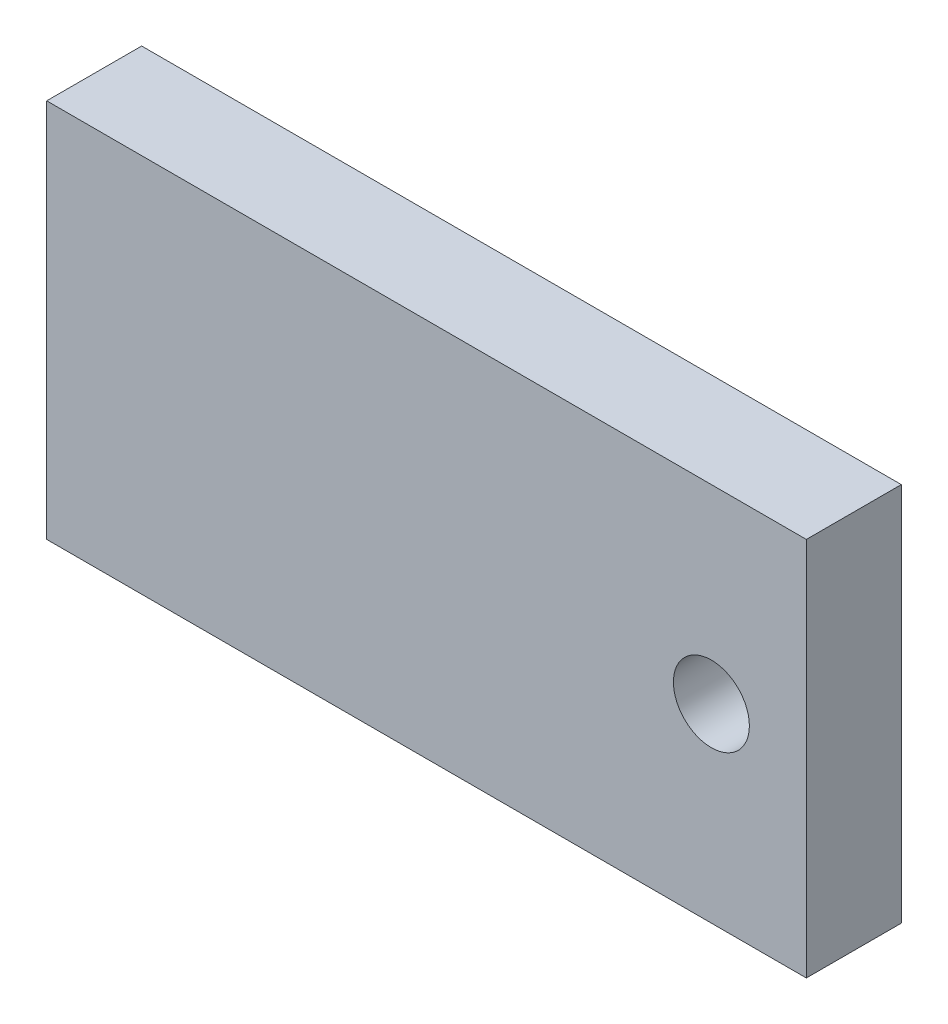
ISO-10303-21;
HEADER;
FILE_DESCRIPTION(('STEP AP214'),'2;1');
FILE_NAME('part.step','',(''),(''),'','','');
FILE_SCHEMA(('AUTOMOTIVE_DESIGN { 1 0 10303 214 1 1 1 1 }'));
ENDSEC;
DATA;
#1=APPLICATION_CONTEXT('core data for automotive mechanical design processes');
#2=APPLICATION_PROTOCOL_DEFINITION('international standard','automotive_design',2000,#1);
#3=PRODUCT_CONTEXT('',#1,'mechanical');
#4=PRODUCT('Part','Part','',(#3));
#5=PRODUCT_RELATED_PRODUCT_CATEGORY('part','',(#4));
#6=PRODUCT_DEFINITION_FORMATION('','',#4);
#7=PRODUCT_DEFINITION_CONTEXT('part definition',#1,'design');
#8=PRODUCT_DEFINITION('design','',#6,#7);
#9=PRODUCT_DEFINITION_SHAPE('','',#8);
#10=(LENGTH_UNIT() NAMED_UNIT(*) SI_UNIT(.MILLI.,.METRE.));
#11=(NAMED_UNIT(*) PLANE_ANGLE_UNIT() SI_UNIT($,.RADIAN.));
#12=(NAMED_UNIT(*) SI_UNIT($,.STERADIAN.) SOLID_ANGLE_UNIT());
#13=UNCERTAINTY_MEASURE_WITH_UNIT(LENGTH_MEASURE(1.E-05),#10,'distance_accuracy_value','');
#14=(GEOMETRIC_REPRESENTATION_CONTEXT(3) GLOBAL_UNCERTAINTY_ASSIGNED_CONTEXT((#13)) GLOBAL_UNIT_ASSIGNED_CONTEXT((#10,
#11,#12)) REPRESENTATION_CONTEXT('',''));
#15=CARTESIAN_POINT('',(0.,0.,0.));
#16=DIRECTION('',(0.,0.,1.));
#17=DIRECTION('',(1.,0.,0.));
#18=AXIS2_PLACEMENT_3D('',#15,#16,#17);
#19=CARTESIAN_POINT('',(0.,0.,5.));
#20=DIRECTION('',(0.,0.,1.));
#21=DIRECTION('',(1.,0.,0.));
#22=AXIS2_PLACEMENT_3D('',#19,#20,#21);
#23=PLANE('',#22);
#24=DIRECTION('',(-1.,0.,0.));
#25=VECTOR('',#24,1.);
#26=CARTESIAN_POINT('',(10.6993238445632,22.6111721998938,5.));
#27=LINE('',#26,#25);
#28=CARTESIAN_POINT('',(10.6993238445632,22.6111721998938,5.));
#29=VERTEX_POINT('',#28);
#30=CARTESIAN_POINT('',(-29.3006761554368,22.6111721998938,5.));
#31=VERTEX_POINT('',#30);
#32=EDGE_CURVE('E85',#29,#31,#27,.T.);
#33=ORIENTED_EDGE('',*,*,#32,.T.);
#34=DIRECTION('',(0.,-1.,0.));
#35=VECTOR('',#34,1.);
#36=CARTESIAN_POINT('',(-29.3006761554368,22.6111721998938,5.));
#37=LINE('',#36,#35);
#38=CARTESIAN_POINT('',(-29.3006761554368,2.61117219989384,5.));
#39=VERTEX_POINT('',#38);
#40=EDGE_CURVE('E80',#31,#39,#37,.T.);
#41=ORIENTED_EDGE('',*,*,#40,.T.);
#42=DIRECTION('',(1.,0.,0.));
#43=VECTOR('',#42,1.);
#44=CARTESIAN_POINT('',(-29.3006761554368,2.61117219989384,5.));
#45=LINE('',#44,#43);
#46=CARTESIAN_POINT('',(10.6993238445632,2.61117219989384,5.));
#47=VERTEX_POINT('',#46);
#48=EDGE_CURVE('E83',#39,#47,#45,.T.);
#49=ORIENTED_EDGE('',*,*,#48,.T.);
#50=DIRECTION('',(0.,1.,0.));
#51=VECTOR('',#50,1.);
#52=CARTESIAN_POINT('',(10.6993238445632,2.61117219989384,5.));
#53=LINE('',#52,#51);
#54=EDGE_CURVE('E51',#47,#29,#53,.T.);
#55=ORIENTED_EDGE('',*,*,#54,.T.);
#56=EDGE_LOOP('',(#33,#41,#49,#55));
#57=FACE_BOUND('',#56,.T.);
#58=CARTESIAN_POINT('',(5.69932384456323,12.6111721998938,5.));
#59=DIRECTION('',(0.,0.,1.));
#60=DIRECTION('',(1.,0.,0.));
#61=AXIS2_PLACEMENT_3D('',#58,#59,#60);
#62=CIRCLE('',#61,2.);
#63=CARTESIAN_POINT('',(7.69932384456323,12.6111721998938,5.));
#64=VERTEX_POINT('',#63);
#65=EDGE_CURVE('E101',#64,#64,#62,.T.);
#66=ORIENTED_EDGE('',*,*,#65,.F.);
#67=EDGE_LOOP('',(#66));
#68=FACE_BOUND('',#67,.T.);
#69=ADVANCED_FACE('F34',(#57,#68),#23,.T.);
#70=CARTESIAN_POINT('',(0.,0.,0.));
#71=DIRECTION('',(0.,0.,1.));
#72=DIRECTION('',(1.,0.,0.));
#73=AXIS2_PLACEMENT_3D('',#70,#71,#72);
#74=PLANE('',#73);
#75=DIRECTION('',(-1.,0.,0.));
#76=VECTOR('',#75,1.);
#77=CARTESIAN_POINT('',(10.6993238445632,22.6111721998938,0.));
#78=LINE('',#77,#76);
#79=CARTESIAN_POINT('',(10.6993238445632,22.6111721998938,0.));
#80=VERTEX_POINT('',#79);
#81=CARTESIAN_POINT('',(-29.3006761554368,22.6111721998938,0.));
#82=VERTEX_POINT('',#81);
#83=EDGE_CURVE('E98',#80,#82,#78,.T.);
#84=ORIENTED_EDGE('',*,*,#83,.F.);
#85=DIRECTION('',(0.,1.,0.));
#86=VECTOR('',#85,1.);
#87=CARTESIAN_POINT('',(10.6993238445632,2.61117219989384,0.));
#88=LINE('',#87,#86);
#89=CARTESIAN_POINT('',(10.6993238445632,2.61117219989384,0.));
#90=VERTEX_POINT('',#89);
#91=EDGE_CURVE('E73',#90,#80,#88,.T.);
#92=ORIENTED_EDGE('',*,*,#91,.F.);
#93=DIRECTION('',(1.,0.,0.));
#94=VECTOR('',#93,1.);
#95=CARTESIAN_POINT('',(0.699323844563227,2.61117219989384,0.));
#96=LINE('',#95,#94);
#97=CARTESIAN_POINT('',(-29.3006761554368,2.61117219989384,0.));
#98=VERTEX_POINT('',#97);
#99=EDGE_CURVE('E67',#98,#90,#96,.T.);
#100=ORIENTED_EDGE('',*,*,#99,.F.);
#101=DIRECTION('',(0.,-1.,0.));
#102=VECTOR('',#101,1.);
#103=CARTESIAN_POINT('',(-29.3006761554368,22.6111721998938,0.));
#104=LINE('',#103,#102);
#105=EDGE_CURVE('E90',#82,#98,#104,.T.);
#106=ORIENTED_EDGE('',*,*,#105,.F.);
#107=EDGE_LOOP('',(#84,#92,#100,#106));
#108=FACE_BOUND('',#107,.T.);
#109=CARTESIAN_POINT('',(5.69932384456323,12.6111721998938,0.));
#110=DIRECTION('',(0.,0.,1.));
#111=DIRECTION('',(1.,0.,0.));
#112=AXIS2_PLACEMENT_3D('',#109,#110,#111);
#113=CIRCLE('',#112,2.);
#114=CARTESIAN_POINT('',(7.69932384456323,12.6111721998938,0.));
#115=VERTEX_POINT('',#114);
#116=EDGE_CURVE('E113',#115,#115,#113,.T.);
#117=ORIENTED_EDGE('',*,*,#116,.T.);
#118=EDGE_LOOP('',(#117));
#119=FACE_BOUND('',#118,.T.);
#120=ADVANCED_FACE('F109',(#108,#119),#74,.F.);
#121=CARTESIAN_POINT('',(10.6993238445632,22.6111721998938,5.));
#122=DIRECTION('',(0.,-1.,0.));
#123=DIRECTION('',(0.,0.,-1.));
#124=AXIS2_PLACEMENT_3D('',#121,#122,#123);
#125=PLANE('',#124);
#126=ORIENTED_EDGE('',*,*,#83,.T.);
#127=DIRECTION('',(0.,0.,-1.));
#128=VECTOR('',#127,1.);
#129=CARTESIAN_POINT('',(-29.3006761554368,22.6111721998938,5.));
#130=LINE('',#129,#128);
#131=EDGE_CURVE('E11',#31,#82,#130,.T.);
#132=ORIENTED_EDGE('',*,*,#131,.F.);
#133=ORIENTED_EDGE('',*,*,#32,.F.);
#134=DIRECTION('',(0.,0.,-1.));
#135=VECTOR('',#134,1.);
#136=CARTESIAN_POINT('',(10.6993238445632,22.6111721998938,5.));
#137=LINE('',#136,#135);
#138=EDGE_CURVE('E94',#29,#80,#137,.T.);
#139=ORIENTED_EDGE('',*,*,#138,.T.);
#140=EDGE_LOOP('',(#126,#132,#133,#139));
#141=FACE_BOUND('',#140,.T.);
#142=ADVANCED_FACE('F36',(#141),#125,.F.);
#143=CARTESIAN_POINT('',(-29.3006761554368,22.6111721998938,5.));
#144=DIRECTION('',(1.,0.,0.));
#145=DIRECTION('',(0.,0.,-1.));
#146=AXIS2_PLACEMENT_3D('',#143,#144,#145);
#147=PLANE('',#146);
#148=ORIENTED_EDGE('',*,*,#105,.T.);
#149=DIRECTION('',(0.,0.,-1.));
#150=VECTOR('',#149,1.);
#151=CARTESIAN_POINT('',(-29.3006761554368,2.61117219989384,5.));
#152=LINE('',#151,#150);
#153=EDGE_CURVE('E43',#39,#98,#152,.T.);
#154=ORIENTED_EDGE('',*,*,#153,.F.);
#155=ORIENTED_EDGE('',*,*,#40,.F.);
#156=ORIENTED_EDGE('',*,*,#131,.T.);
#157=EDGE_LOOP('',(#148,#154,#155,#156));
#158=FACE_BOUND('',#157,.T.);
#159=ADVANCED_FACE('F89',(#158),#147,.F.);
#160=CARTESIAN_POINT('',(0.699323844563227,2.61117219989384,5.));
#161=DIRECTION('',(0.,1.,0.));
#162=DIRECTION('',(0.,0.,1.));
#163=AXIS2_PLACEMENT_3D('',#160,#161,#162);
#164=PLANE('',#163);
#165=ORIENTED_EDGE('',*,*,#99,.T.);
#166=DIRECTION('',(0.,0.,-1.));
#167=VECTOR('',#166,1.);
#168=CARTESIAN_POINT('',(10.6993238445632,2.61117219989384,5.));
#169=LINE('',#168,#167);
#170=EDGE_CURVE('E91',#47,#90,#169,.T.);
#171=ORIENTED_EDGE('',*,*,#170,.F.);
#172=ORIENTED_EDGE('',*,*,#48,.F.);
#173=ORIENTED_EDGE('',*,*,#153,.T.);
#174=EDGE_LOOP('',(#165,#171,#172,#173));
#175=FACE_BOUND('',#174,.T.);
#176=ADVANCED_FACE('F92',(#175),#164,.F.);
#177=CARTESIAN_POINT('',(10.6993238445632,2.61117219989384,5.));
#178=DIRECTION('',(-1.,0.,0.));
#179=DIRECTION('',(0.,0.,1.));
#180=AXIS2_PLACEMENT_3D('',#177,#178,#179);
#181=PLANE('',#180);
#182=ORIENTED_EDGE('',*,*,#91,.T.);
#183=ORIENTED_EDGE('',*,*,#138,.F.);
#184=ORIENTED_EDGE('',*,*,#54,.F.);
#185=ORIENTED_EDGE('',*,*,#170,.T.);
#186=EDGE_LOOP('',(#182,#183,#184,#185));
#187=FACE_BOUND('',#186,.T.);
#188=ADVANCED_FACE('F106',(#187),#181,.F.);
#189=CARTESIAN_POINT('',(5.69932384456323,12.6111721998938,5.));
#190=DIRECTION('',(0.,0.,-1.));
#191=DIRECTION('',(-1.,0.,0.));
#192=AXIS2_PLACEMENT_3D('',#189,#190,#191);
#193=CYLINDRICAL_SURFACE('',#192,2.);
#194=ORIENTED_EDGE('',*,*,#65,.T.);
#195=EDGE_LOOP('',(#194));
#196=FACE_BOUND('',#195,.T.);
#197=ORIENTED_EDGE('',*,*,#116,.F.);
#198=EDGE_LOOP('',(#197));
#199=FACE_BOUND('',#198,.T.);
#200=ADVANCED_FACE('F119',(#196,#199),#193,.F.);
#201=CLOSED_SHELL('',(#69,#120,#142,#159,#176,#188,#200));
#202=MANIFOLD_SOLID_BREP('B2',#201);
#203=ADVANCED_BREP_SHAPE_REPRESENTATION('',(#18,#202),#14);
#204=SHAPE_DEFINITION_REPRESENTATION(#9,#203);
ENDSEC;
END-ISO-10303-21;
